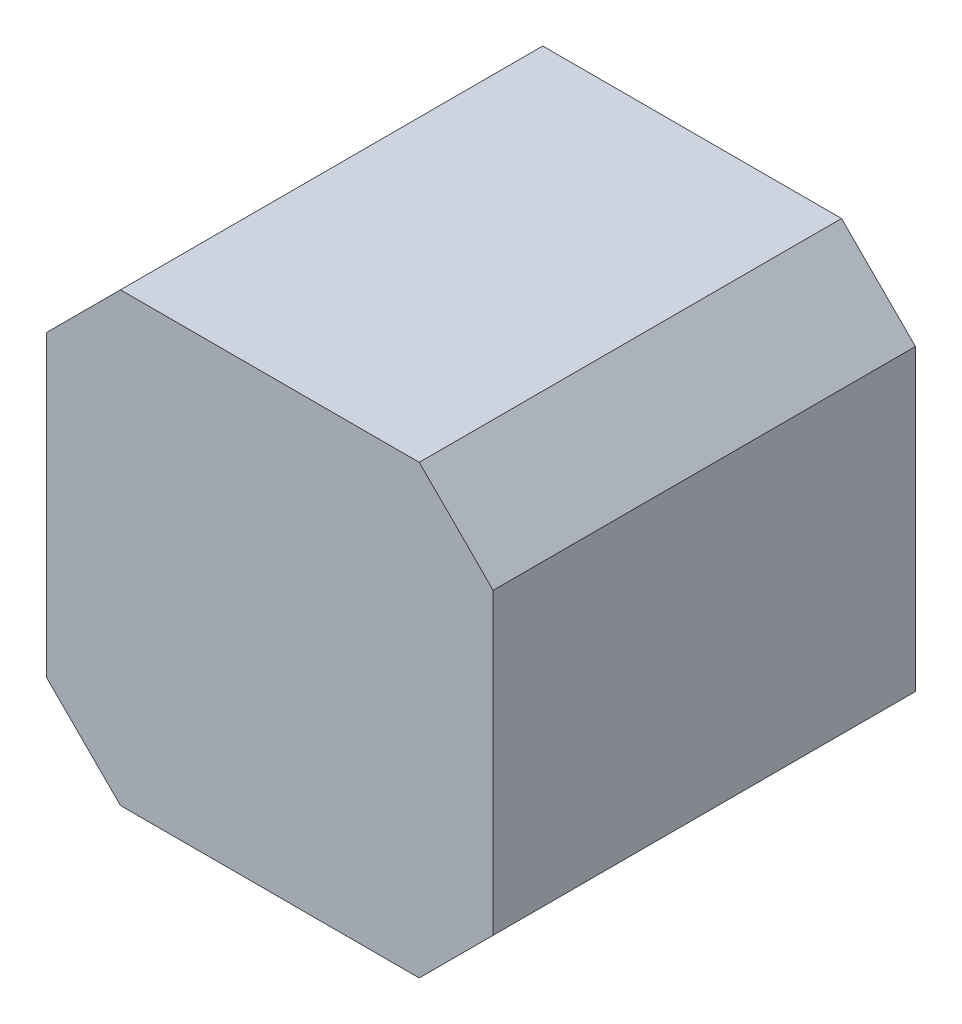
ISO-10303-21;
HEADER;
FILE_DESCRIPTION(('STEP AP214'),'2;1');
FILE_NAME('part.step','',(''),(''),'','','');
FILE_SCHEMA(('AUTOMOTIVE_DESIGN { 1 0 10303 214 1 1 1 1 }'));
ENDSEC;
DATA;
#1=APPLICATION_CONTEXT('core data for automotive mechanical design processes');
#2=APPLICATION_PROTOCOL_DEFINITION('international standard','automotive_design',2000,#1);
#3=PRODUCT_CONTEXT('',#1,'mechanical');
#4=PRODUCT('Part','Part','',(#3));
#5=PRODUCT_RELATED_PRODUCT_CATEGORY('part','',(#4));
#6=PRODUCT_DEFINITION_FORMATION('','',#4);
#7=PRODUCT_DEFINITION_CONTEXT('part definition',#1,'design');
#8=PRODUCT_DEFINITION('design','',#6,#7);
#9=PRODUCT_DEFINITION_SHAPE('','',#8);
#10=(LENGTH_UNIT() NAMED_UNIT(*) SI_UNIT(.MILLI.,.METRE.));
#11=(NAMED_UNIT(*) PLANE_ANGLE_UNIT() SI_UNIT($,.RADIAN.));
#12=(NAMED_UNIT(*) SI_UNIT($,.STERADIAN.) SOLID_ANGLE_UNIT());
#13=UNCERTAINTY_MEASURE_WITH_UNIT(LENGTH_MEASURE(1.E-05),#10,'distance_accuracy_value','');
#14=(GEOMETRIC_REPRESENTATION_CONTEXT(3) GLOBAL_UNCERTAINTY_ASSIGNED_CONTEXT((#13)) GLOBAL_UNIT_ASSIGNED_CONTEXT((#10,
#11,#12)) REPRESENTATION_CONTEXT('',''));
#15=CARTESIAN_POINT('',(0.,0.,0.));
#16=DIRECTION('',(0.,0.,1.));
#17=DIRECTION('',(1.,0.,0.));
#18=AXIS2_PLACEMENT_3D('',#15,#16,#17);
#19=CARTESIAN_POINT('',(-21.15,14.15,40.));
#20=DIRECTION('',(1.,0.,0.));
#21=DIRECTION('',(0.,0.,-1.));
#22=AXIS2_PLACEMENT_3D('',#19,#20,#21);
#23=PLANE('',#22);
#24=DIRECTION('',(0.,-1.,0.));
#25=VECTOR('',#24,1.);
#26=CARTESIAN_POINT('',(-21.15,14.15,0.));
#27=LINE('',#26,#25);
#28=CARTESIAN_POINT('',(-21.15,14.15,0.));
#29=VERTEX_POINT('',#28);
#30=CARTESIAN_POINT('',(-21.15,-14.15,0.));
#31=VERTEX_POINT('',#30);
#32=EDGE_CURVE('E129',#29,#31,#27,.T.);
#33=ORIENTED_EDGE('',*,*,#32,.T.);
#34=DIRECTION('',(0.,0.,-1.));
#35=VECTOR('',#34,1.);
#36=CARTESIAN_POINT('',(-21.15,-14.15,40.));
#37=LINE('',#36,#35);
#38=CARTESIAN_POINT('',(-21.15,-14.15,40.));
#39=VERTEX_POINT('',#38);
#40=EDGE_CURVE('E11',#39,#31,#37,.T.);
#41=ORIENTED_EDGE('',*,*,#40,.F.);
#42=DIRECTION('',(0.,-1.,0.));
#43=VECTOR('',#42,1.);
#44=CARTESIAN_POINT('',(-21.15,14.15,40.));
#45=LINE('',#44,#43);
#46=CARTESIAN_POINT('',(-21.15,14.15,40.));
#47=VERTEX_POINT('',#46);
#48=EDGE_CURVE('E143',#47,#39,#45,.T.);
#49=ORIENTED_EDGE('',*,*,#48,.F.);
#50=DIRECTION('',(0.,0.,-1.));
#51=VECTOR('',#50,1.);
#52=CARTESIAN_POINT('',(-21.15,14.15,40.));
#53=LINE('',#52,#51);
#54=EDGE_CURVE('E125',#47,#29,#53,.T.);
#55=ORIENTED_EDGE('',*,*,#54,.T.);
#56=EDGE_LOOP('',(#33,#41,#49,#55));
#57=FACE_BOUND('',#56,.T.);
#58=ADVANCED_FACE('F33',(#57),#23,.F.);
#59=CARTESIAN_POINT('',(-21.15,-14.15,40.));
#60=DIRECTION('',(0.707106781186548,0.707106781186548,0.));
#61=DIRECTION('',(-0.707106781186548,0.707106781186548,0.));
#62=AXIS2_PLACEMENT_3D('',#59,#60,#61);
#63=PLANE('',#62);
#64=DIRECTION('',(0.707106781186547,-0.707106781186547,0.));
#65=VECTOR('',#64,1.);
#66=CARTESIAN_POINT('',(-21.15,-14.15,0.));
#67=LINE('',#66,#65);
#68=CARTESIAN_POINT('',(-14.15,-21.15,0.));
#69=VERTEX_POINT('',#68);
#70=EDGE_CURVE('E132',#31,#69,#67,.T.);
#71=ORIENTED_EDGE('',*,*,#70,.T.);
#72=DIRECTION('',(0.,0.,-1.));
#73=VECTOR('',#72,1.);
#74=CARTESIAN_POINT('',(-14.15,-21.15,40.));
#75=LINE('',#74,#73);
#76=CARTESIAN_POINT('',(-14.15,-21.15,40.));
#77=VERTEX_POINT('',#76);
#78=EDGE_CURVE('E41',#77,#69,#75,.T.);
#79=ORIENTED_EDGE('',*,*,#78,.F.);
#80=DIRECTION('',(0.707106781186547,-0.707106781186547,0.));
#81=VECTOR('',#80,1.);
#82=CARTESIAN_POINT('',(-21.15,-14.15,40.));
#83=LINE('',#82,#81);
#84=EDGE_CURVE('E92',#39,#77,#83,.T.);
#85=ORIENTED_EDGE('',*,*,#84,.F.);
#86=ORIENTED_EDGE('',*,*,#40,.T.);
#87=EDGE_LOOP('',(#71,#79,#85,#86));
#88=FACE_BOUND('',#87,.T.);
#89=ADVANCED_FACE('F178',(#88),#63,.F.);
#90=CARTESIAN_POINT('',(-14.15,-21.15,40.));
#91=DIRECTION('',(0.,1.,0.));
#92=DIRECTION('',(0.,0.,1.));
#93=AXIS2_PLACEMENT_3D('',#90,#91,#92);
#94=PLANE('',#93);
#95=DIRECTION('',(1.,0.,0.));
#96=VECTOR('',#95,1.);
#97=CARTESIAN_POINT('',(-14.15,-21.15,0.));
#98=LINE('',#97,#96);
#99=CARTESIAN_POINT('',(14.15,-21.15,0.));
#100=VERTEX_POINT('',#99);
#101=EDGE_CURVE('E134',#69,#100,#98,.T.);
#102=ORIENTED_EDGE('',*,*,#101,.T.);
#103=DIRECTION('',(0.,0.,-1.));
#104=VECTOR('',#103,1.);
#105=CARTESIAN_POINT('',(14.15,-21.15,40.));
#106=LINE('',#105,#104);
#107=CARTESIAN_POINT('',(14.15,-21.15,40.));
#108=VERTEX_POINT('',#107);
#109=EDGE_CURVE('E150',#108,#100,#106,.T.);
#110=ORIENTED_EDGE('',*,*,#109,.F.);
#111=DIRECTION('',(1.,0.,0.));
#112=VECTOR('',#111,1.);
#113=CARTESIAN_POINT('',(-14.15,-21.15,40.));
#114=LINE('',#113,#112);
#115=EDGE_CURVE('E158',#77,#108,#114,.T.);
#116=ORIENTED_EDGE('',*,*,#115,.F.);
#117=ORIENTED_EDGE('',*,*,#78,.T.);
#118=EDGE_LOOP('',(#102,#110,#116,#117));
#119=FACE_BOUND('',#118,.T.);
#120=ADVANCED_FACE('F156',(#119),#94,.F.);
#121=CARTESIAN_POINT('',(21.15,-14.15,40.));
#122=DIRECTION('',(-0.707106781186548,0.707106781186548,0.));
#123=DIRECTION('',(-0.707106781186548,-0.707106781186548,0.));
#124=AXIS2_PLACEMENT_3D('',#121,#122,#123);
#125=PLANE('',#124);
#126=DIRECTION('',(0.707106781186547,0.707106781186547,0.));
#127=VECTOR('',#126,1.);
#128=CARTESIAN_POINT('',(21.15,-14.15,0.));
#129=LINE('',#128,#127);
#130=CARTESIAN_POINT('',(21.15,-14.15,0.));
#131=VERTEX_POINT('',#130);
#132=EDGE_CURVE('E136',#100,#131,#129,.T.);
#133=ORIENTED_EDGE('',*,*,#132,.T.);
#134=DIRECTION('',(0.,0.,-1.));
#135=VECTOR('',#134,1.);
#136=CARTESIAN_POINT('',(21.15,-14.15,40.));
#137=LINE('',#136,#135);
#138=CARTESIAN_POINT('',(21.15,-14.15,40.));
#139=VERTEX_POINT('',#138);
#140=EDGE_CURVE('E147',#139,#131,#137,.T.);
#141=ORIENTED_EDGE('',*,*,#140,.F.);
#142=DIRECTION('',(0.707106781186547,0.707106781186547,0.));
#143=VECTOR('',#142,1.);
#144=CARTESIAN_POINT('',(21.15,-14.15,40.));
#145=LINE('',#144,#143);
#146=EDGE_CURVE('E170',#108,#139,#145,.T.);
#147=ORIENTED_EDGE('',*,*,#146,.F.);
#148=ORIENTED_EDGE('',*,*,#109,.T.);
#149=EDGE_LOOP('',(#133,#141,#147,#148));
#150=FACE_BOUND('',#149,.T.);
#151=ADVANCED_FACE('F166',(#150),#125,.F.);
#152=CARTESIAN_POINT('',(21.15,14.15,40.));
#153=DIRECTION('',(-1.,0.,0.));
#154=DIRECTION('',(0.,-1.,0.));
#155=AXIS2_PLACEMENT_3D('',#152,#153,#154);
#156=PLANE('',#155);
#157=DIRECTION('',(0.,1.,0.));
#158=VECTOR('',#157,1.);
#159=CARTESIAN_POINT('',(21.15,14.15,0.));
#160=LINE('',#159,#158);
#161=CARTESIAN_POINT('',(21.15,14.15,0.));
#162=VERTEX_POINT('',#161);
#163=EDGE_CURVE('E138',#131,#162,#160,.T.);
#164=ORIENTED_EDGE('',*,*,#163,.T.);
#165=DIRECTION('',(0.,0.,-1.));
#166=VECTOR('',#165,1.);
#167=CARTESIAN_POINT('',(21.15,14.15,40.));
#168=LINE('',#167,#166);
#169=CARTESIAN_POINT('',(21.15,14.15,40.));
#170=VERTEX_POINT('',#169);
#171=EDGE_CURVE('E120',#170,#162,#168,.T.);
#172=ORIENTED_EDGE('',*,*,#171,.F.);
#173=DIRECTION('',(0.,1.,0.));
#174=VECTOR('',#173,1.);
#175=CARTESIAN_POINT('',(21.15,14.15,40.));
#176=LINE('',#175,#174);
#177=EDGE_CURVE('E111',#139,#170,#176,.T.);
#178=ORIENTED_EDGE('',*,*,#177,.F.);
#179=ORIENTED_EDGE('',*,*,#140,.T.);
#180=EDGE_LOOP('',(#164,#172,#178,#179));
#181=FACE_BOUND('',#180,.T.);
#182=ADVANCED_FACE('F169',(#181),#156,.F.);
#183=CARTESIAN_POINT('',(14.15,21.15,40.));
#184=DIRECTION('',(-0.707106781186548,-0.707106781186548,0.));
#185=DIRECTION('',(0.707106781186548,-0.707106781186548,0.));
#186=AXIS2_PLACEMENT_3D('',#183,#184,#185);
#187=PLANE('',#186);
#188=DIRECTION('',(-0.707106781186547,0.707106781186547,0.));
#189=VECTOR('',#188,1.);
#190=CARTESIAN_POINT('',(14.15,21.15,0.));
#191=LINE('',#190,#189);
#192=CARTESIAN_POINT('',(14.15,21.15,0.));
#193=VERTEX_POINT('',#192);
#194=EDGE_CURVE('E119',#162,#193,#191,.T.);
#195=ORIENTED_EDGE('',*,*,#194,.T.);
#196=DIRECTION('',(0.,0.,-1.));
#197=VECTOR('',#196,1.);
#198=CARTESIAN_POINT('',(14.15,21.15,40.));
#199=LINE('',#198,#197);
#200=CARTESIAN_POINT('',(14.15,21.15,40.));
#201=VERTEX_POINT('',#200);
#202=EDGE_CURVE('E116',#201,#193,#199,.T.);
#203=ORIENTED_EDGE('',*,*,#202,.F.);
#204=DIRECTION('',(-0.707106781186547,0.707106781186547,0.));
#205=VECTOR('',#204,1.);
#206=CARTESIAN_POINT('',(14.15,21.15,40.));
#207=LINE('',#206,#205);
#208=EDGE_CURVE('E105',#170,#201,#207,.T.);
#209=ORIENTED_EDGE('',*,*,#208,.F.);
#210=ORIENTED_EDGE('',*,*,#171,.T.);
#211=EDGE_LOOP('',(#195,#203,#209,#210));
#212=FACE_BOUND('',#211,.T.);
#213=ADVANCED_FACE('F117',(#212),#187,.F.);
#214=CARTESIAN_POINT('',(-14.15,21.15,40.));
#215=DIRECTION('',(0.,-1.,0.));
#216=DIRECTION('',(0.,0.,-1.));
#217=AXIS2_PLACEMENT_3D('',#214,#215,#216);
#218=PLANE('',#217);
#219=DIRECTION('',(-1.,0.,0.));
#220=VECTOR('',#219,1.);
#221=CARTESIAN_POINT('',(-14.15,21.15,0.));
#222=LINE('',#221,#220);
#223=CARTESIAN_POINT('',(-14.15,21.15,0.));
#224=VERTEX_POINT('',#223);
#225=EDGE_CURVE('E78',#193,#224,#222,.T.);
#226=ORIENTED_EDGE('',*,*,#225,.T.);
#227=DIRECTION('',(0.,0.,-1.));
#228=VECTOR('',#227,1.);
#229=CARTESIAN_POINT('',(-14.15,21.15,40.));
#230=LINE('',#229,#228);
#231=CARTESIAN_POINT('',(-14.15,21.15,40.));
#232=VERTEX_POINT('',#231);
#233=EDGE_CURVE('E121',#232,#224,#230,.T.);
#234=ORIENTED_EDGE('',*,*,#233,.F.);
#235=DIRECTION('',(-1.,0.,0.));
#236=VECTOR('',#235,1.);
#237=CARTESIAN_POINT('',(-14.15,21.15,40.));
#238=LINE('',#237,#236);
#239=EDGE_CURVE('E109',#201,#232,#238,.T.);
#240=ORIENTED_EDGE('',*,*,#239,.F.);
#241=ORIENTED_EDGE('',*,*,#202,.T.);
#242=EDGE_LOOP('',(#226,#234,#240,#241));
#243=FACE_BOUND('',#242,.T.);
#244=ADVANCED_FACE('F123',(#243),#218,.F.);
#245=CARTESIAN_POINT('',(-14.15,21.15,40.));
#246=DIRECTION('',(0.707106781186548,-0.707106781186548,0.));
#247=DIRECTION('',(0.707106781186548,0.707106781186548,0.));
#248=AXIS2_PLACEMENT_3D('',#245,#246,#247);
#249=PLANE('',#248);
#250=DIRECTION('',(-0.707106781186547,-0.707106781186547,0.));
#251=VECTOR('',#250,1.);
#252=CARTESIAN_POINT('',(-14.15,21.15,0.));
#253=LINE('',#252,#251);
#254=EDGE_CURVE('E84',#224,#29,#253,.T.);
#255=ORIENTED_EDGE('',*,*,#254,.T.);
#256=ORIENTED_EDGE('',*,*,#54,.F.);
#257=DIRECTION('',(-0.707106781186547,-0.707106781186547,0.));
#258=VECTOR('',#257,1.);
#259=CARTESIAN_POINT('',(-14.15,21.15,40.));
#260=LINE('',#259,#258);
#261=EDGE_CURVE('E49',#232,#47,#260,.T.);
#262=ORIENTED_EDGE('',*,*,#261,.F.);
#263=ORIENTED_EDGE('',*,*,#233,.T.);
#264=EDGE_LOOP('',(#255,#256,#262,#263));
#265=FACE_BOUND('',#264,.T.);
#266=ADVANCED_FACE('F194',(#265),#249,.F.);
#267=CARTESIAN_POINT('',(0.,0.,40.));
#268=DIRECTION('',(0.,0.,1.));
#269=DIRECTION('',(1.,0.,0.));
#270=AXIS2_PLACEMENT_3D('',#267,#268,#269);
#271=PLANE('',#270);
#272=ORIENTED_EDGE('',*,*,#48,.T.);
#273=ORIENTED_EDGE('',*,*,#84,.T.);
#274=ORIENTED_EDGE('',*,*,#115,.T.);
#275=ORIENTED_EDGE('',*,*,#146,.T.);
#276=ORIENTED_EDGE('',*,*,#177,.T.);
#277=ORIENTED_EDGE('',*,*,#208,.T.);
#278=ORIENTED_EDGE('',*,*,#239,.T.);
#279=ORIENTED_EDGE('',*,*,#261,.T.);
#280=EDGE_LOOP('',(#272,#273,#274,#275,#276,#277,#278,#279));
#281=FACE_BOUND('',#280,.T.);
#282=ADVANCED_FACE('F107',(#281),#271,.T.);
#283=CARTESIAN_POINT('',(0.,0.,0.));
#284=DIRECTION('',(0.,0.,1.));
#285=DIRECTION('',(1.,0.,0.));
#286=AXIS2_PLACEMENT_3D('',#283,#284,#285);
#287=PLANE('',#286);
#288=ORIENTED_EDGE('',*,*,#32,.F.);
#289=ORIENTED_EDGE('',*,*,#254,.F.);
#290=ORIENTED_EDGE('',*,*,#225,.F.);
#291=ORIENTED_EDGE('',*,*,#194,.F.);
#292=ORIENTED_EDGE('',*,*,#163,.F.);
#293=ORIENTED_EDGE('',*,*,#132,.F.);
#294=ORIENTED_EDGE('',*,*,#101,.F.);
#295=ORIENTED_EDGE('',*,*,#70,.F.);
#296=EDGE_LOOP('',(#288,#289,#290,#291,#292,#293,#294,#295));
#297=FACE_BOUND('',#296,.T.);
#298=ADVANCED_FACE('F162',(#297),#287,.F.);
#299=CLOSED_SHELL('',(#58,#89,#120,#151,#182,#213,#244,#266,#282,#298));
#300=MANIFOLD_SOLID_BREP('B2',#299);
#301=ADVANCED_BREP_SHAPE_REPRESENTATION('',(#18,#300),#14);
#302=SHAPE_DEFINITION_REPRESENTATION(#9,#301);
ENDSEC;
END-ISO-10303-21;
